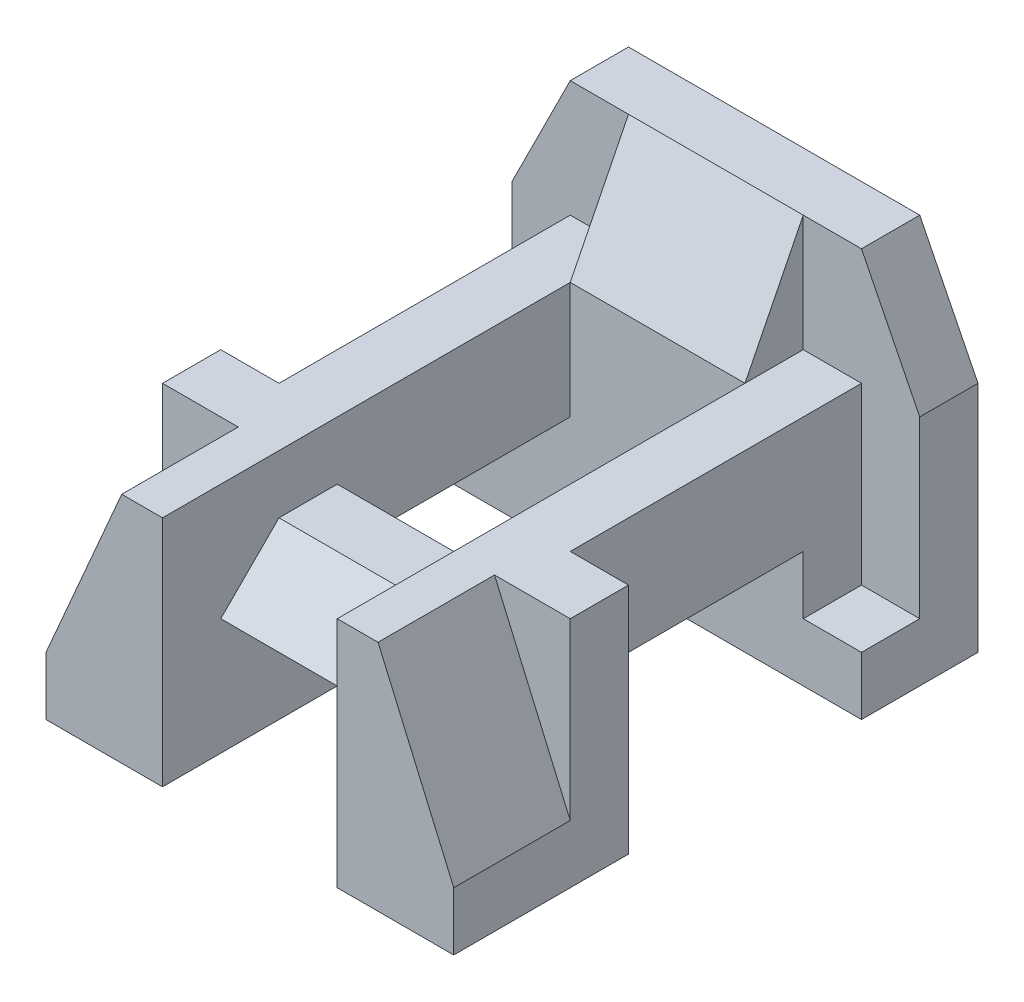
ISO-10303-21;
HEADER;
FILE_DESCRIPTION(('STEP AP214'),'2;1');
FILE_NAME('part.step','',(''),(''),'','','');
FILE_SCHEMA(('AUTOMOTIVE_DESIGN { 1 0 10303 214 1 1 1 1 }'));
ENDSEC;
DATA;
#1=APPLICATION_CONTEXT('core data for automotive mechanical design processes');
#2=APPLICATION_PROTOCOL_DEFINITION('international standard','automotive_design',2000,#1);
#3=PRODUCT_CONTEXT('',#1,'mechanical');
#4=PRODUCT('Part','Part','',(#3));
#5=PRODUCT_RELATED_PRODUCT_CATEGORY('part','',(#4));
#6=PRODUCT_DEFINITION_FORMATION('','',#4);
#7=PRODUCT_DEFINITION_CONTEXT('part definition',#1,'design');
#8=PRODUCT_DEFINITION('design','',#6,#7);
#9=PRODUCT_DEFINITION_SHAPE('','',#8);
#10=(LENGTH_UNIT() NAMED_UNIT(*) SI_UNIT(.MILLI.,.METRE.));
#11=(NAMED_UNIT(*) PLANE_ANGLE_UNIT() SI_UNIT($,.RADIAN.));
#12=(NAMED_UNIT(*) SI_UNIT($,.STERADIAN.) SOLID_ANGLE_UNIT());
#13=UNCERTAINTY_MEASURE_WITH_UNIT(LENGTH_MEASURE(1.E-05),#10,'distance_accuracy_value','');
#14=(GEOMETRIC_REPRESENTATION_CONTEXT(3) GLOBAL_UNCERTAINTY_ASSIGNED_CONTEXT((#13)) GLOBAL_UNIT_ASSIGNED_CONTEXT((#10,
#11,#12)) REPRESENTATION_CONTEXT('',''));
#15=CARTESIAN_POINT('',(0.,0.,0.));
#16=DIRECTION('',(0.,0.,1.));
#17=DIRECTION('',(1.,0.,0.));
#18=AXIS2_PLACEMENT_3D('',#15,#16,#17);
#19=CARTESIAN_POINT('',(1.5,0.,7.));
#20=DIRECTION('',(0.,-1.,0.));
#21=DIRECTION('',(1.,0.,0.));
#22=AXIS2_PLACEMENT_3D('',#19,#20,#21);
#23=PLANE('',#22);
#24=DIRECTION('',(-1.,0.,0.));
#25=VECTOR('',#24,1.);
#26=CARTESIAN_POINT('',(1.5,0.,7.));
#27=LINE('',#26,#25);
#28=CARTESIAN_POINT('',(1.5,0.,7.));
#29=VERTEX_POINT('',#28);
#30=CARTESIAN_POINT('',(-1.5,0.,7.));
#31=VERTEX_POINT('',#30);
#32=EDGE_CURVE('E48',#29,#31,#27,.T.);
#33=ORIENTED_EDGE('',*,*,#32,.F.);
#34=DIRECTION('',(0.,0.,1.));
#35=VECTOR('',#34,1.);
#36=CARTESIAN_POINT('',(1.5,0.,7.));
#37=LINE('',#36,#35);
#38=CARTESIAN_POINT('',(1.5,0.,6.));
#39=VERTEX_POINT('',#38);
#40=EDGE_CURVE('E283',#39,#29,#37,.T.);
#41=ORIENTED_EDGE('',*,*,#40,.F.);
#42=DIRECTION('',(1.,0.,0.));
#43=VECTOR('',#42,1.);
#44=CARTESIAN_POINT('',(-1.5,0.,6.));
#45=LINE('',#44,#43);
#46=CARTESIAN_POINT('',(-1.5,0.,6.));
#47=VERTEX_POINT('',#46);
#48=EDGE_CURVE('E534',#47,#39,#45,.T.);
#49=ORIENTED_EDGE('',*,*,#48,.F.);
#50=DIRECTION('',(0.,0.,1.));
#51=VECTOR('',#50,1.);
#52=CARTESIAN_POINT('',(-1.5,0.,7.));
#53=LINE('',#52,#51);
#54=EDGE_CURVE('E537',#47,#31,#53,.T.);
#55=ORIENTED_EDGE('',*,*,#54,.T.);
#56=EDGE_LOOP('',(#33,#41,#49,#55));
#57=FACE_BOUND('',#56,.T.);
#58=ADVANCED_FACE('F33',(#57),#23,.F.);
#59=CARTESIAN_POINT('',(3.5,-3.,9.));
#60=DIRECTION('',(0.,1.,0.));
#61=DIRECTION('',(-1.,0.,0.));
#62=AXIS2_PLACEMENT_3D('',#59,#60,#61);
#63=PLANE('',#62);
#64=DIRECTION('',(-1.,0.,0.));
#65=VECTOR('',#64,1.);
#66=CARTESIAN_POINT('',(3.5,-3.,2.));
#67=LINE('',#66,#65);
#68=CARTESIAN_POINT('',(3.5,-3.,2.));
#69=VERTEX_POINT('',#68);
#70=CARTESIAN_POINT('',(-3.5,-3.,2.));
#71=VERTEX_POINT('',#70);
#72=EDGE_CURVE('E315',#69,#71,#67,.T.);
#73=ORIENTED_EDGE('',*,*,#72,.T.);
#74=DIRECTION('',(0.,0.,-1.));
#75=VECTOR('',#74,1.);
#76=CARTESIAN_POINT('',(-3.5,-3.,9.));
#77=LINE('',#76,#75);
#78=CARTESIAN_POINT('',(-3.5,-3.,0.));
#79=VERTEX_POINT('',#78);
#80=EDGE_CURVE('E424',#71,#79,#77,.T.);
#81=ORIENTED_EDGE('',*,*,#80,.T.);
#82=DIRECTION('',(1.,0.,0.));
#83=VECTOR('',#82,1.);
#84=CARTESIAN_POINT('',(3.5,-3.,0.));
#85=LINE('',#84,#83);
#86=CARTESIAN_POINT('',(3.5,-3.,0.));
#87=VERTEX_POINT('',#86);
#88=EDGE_CURVE('E413',#79,#87,#85,.T.);
#89=ORIENTED_EDGE('',*,*,#88,.T.);
#90=DIRECTION('',(0.,0.,-1.));
#91=VECTOR('',#90,1.);
#92=CARTESIAN_POINT('',(3.5,-3.,9.));
#93=LINE('',#92,#91);
#94=EDGE_CURVE('E410',#69,#87,#93,.T.);
#95=ORIENTED_EDGE('',*,*,#94,.F.);
#96=EDGE_LOOP('',(#73,#81,#89,#95));
#97=FACE_BOUND('',#96,.T.);
#98=ADVANCED_FACE('F432',(#97),#63,.F.);
#99=DIRECTION('',(0.,0.,-1.));
#100=VECTOR('',#99,1.);
#101=CARTESIAN_POINT('',(-2.5,-3.,2.));
#102=LINE('',#101,#100);
#103=CARTESIAN_POINT('',(-2.5,-3.,6.));
#104=VERTEX_POINT('',#103);
#105=CARTESIAN_POINT('',(-2.5,-3.,5.));
#106=VERTEX_POINT('',#105);
#107=EDGE_CURVE('E308',#104,#106,#102,.T.);
#108=ORIENTED_EDGE('',*,*,#107,.T.);
#109=DIRECTION('',(1.,0.,0.));
#110=VECTOR('',#109,1.);
#111=CARTESIAN_POINT('',(-37.5,-3.00000000000001,5.));
#112=LINE('',#111,#110);
#113=CARTESIAN_POINT('',(-1.5,-3.,5.));
#114=VERTEX_POINT('',#113);
#115=EDGE_CURVE('E479',#106,#114,#112,.T.);
#116=ORIENTED_EDGE('',*,*,#115,.T.);
#117=DIRECTION('',(0.,0.,1.));
#118=VECTOR('',#117,1.);
#119=CARTESIAN_POINT('',(-1.5,-3.,9.));
#120=LINE('',#119,#118);
#121=CARTESIAN_POINT('',(-1.5,-3.,9.));
#122=VERTEX_POINT('',#121);
#123=EDGE_CURVE('E392',#114,#122,#120,.T.);
#124=ORIENTED_EDGE('',*,*,#123,.T.);
#125=DIRECTION('',(1.,0.,0.));
#126=VECTOR('',#125,1.);
#127=CARTESIAN_POINT('',(3.5,-3.,9.));
#128=LINE('',#127,#126);
#129=CARTESIAN_POINT('',(-3.5,-3.,9.));
#130=VERTEX_POINT('',#129);
#131=EDGE_CURVE('E404',#130,#122,#128,.T.);
#132=ORIENTED_EDGE('',*,*,#131,.F.);
#133=CARTESIAN_POINT('',(-3.5,-3.,6.));
#134=VERTEX_POINT('',#133);
#135=EDGE_CURVE('E425',#130,#134,#77,.T.);
#136=ORIENTED_EDGE('',*,*,#135,.T.);
#137=DIRECTION('',(1.,0.,0.));
#138=VECTOR('',#137,1.);
#139=CARTESIAN_POINT('',(-2.5,-3.,6.));
#140=LINE('',#139,#138);
#141=EDGE_CURVE('E305',#134,#104,#140,.T.);
#142=ORIENTED_EDGE('',*,*,#141,.T.);
#143=EDGE_LOOP('',(#108,#116,#124,#132,#136,#142));
#144=FACE_BOUND('',#143,.T.);
#145=ADVANCED_FACE('F661',(#144),#63,.F.);
#146=CARTESIAN_POINT('',(3.5,3.,9.));
#147=DIRECTION('',(0.,-1.,0.));
#148=DIRECTION('',(1.,0.,0.));
#149=AXIS2_PLACEMENT_3D('',#146,#147,#148);
#150=PLANE('',#149);
#151=DIRECTION('',(0.,0.,-1.));
#152=VECTOR('',#151,1.);
#153=CARTESIAN_POINT('',(-2.5,3.,1.));
#154=LINE('',#153,#152);
#155=CARTESIAN_POINT('',(-2.5,3.,1.));
#156=VERTEX_POINT('',#155);
#157=CARTESIAN_POINT('',(-2.5,3.,0.));
#158=VERTEX_POINT('',#157);
#159=EDGE_CURVE('E373',#156,#158,#154,.T.);
#160=ORIENTED_EDGE('',*,*,#159,.F.);
#161=DIRECTION('',(-1.,0.,0.));
#162=VECTOR('',#161,1.);
#163=CARTESIAN_POINT('',(-1.5,3.,1.));
#164=LINE('',#163,#162);
#165=CARTESIAN_POINT('',(-1.5,3.,1.));
#166=VERTEX_POINT('',#165);
#167=EDGE_CURVE('E508',#166,#156,#164,.T.);
#168=ORIENTED_EDGE('',*,*,#167,.F.);
#169=DIRECTION('',(-1.,0.,0.));
#170=VECTOR('',#169,1.);
#171=CARTESIAN_POINT('',(-1.5,3.,1.));
#172=LINE('',#171,#170);
#173=CARTESIAN_POINT('',(1.5,3.,1.));
#174=VERTEX_POINT('',#173);
#175=EDGE_CURVE('E520',#174,#166,#172,.T.);
#176=ORIENTED_EDGE('',*,*,#175,.F.);
#177=DIRECTION('',(1.,0.,0.));
#178=VECTOR('',#177,1.);
#179=CARTESIAN_POINT('',(1.5,3.,1.));
#180=LINE('',#179,#178);
#181=CARTESIAN_POINT('',(2.5,3.,1.));
#182=VERTEX_POINT('',#181);
#183=EDGE_CURVE('E518',#174,#182,#180,.T.);
#184=ORIENTED_EDGE('',*,*,#183,.T.);
#185=DIRECTION('',(0.,0.,-1.));
#186=VECTOR('',#185,1.);
#187=CARTESIAN_POINT('',(2.5,3.,1.));
#188=LINE('',#187,#186);
#189=CARTESIAN_POINT('',(2.5,3.,0.));
#190=VERTEX_POINT('',#189);
#191=EDGE_CURVE('E385',#182,#190,#188,.T.);
#192=ORIENTED_EDGE('',*,*,#191,.T.);
#193=DIRECTION('',(-1.,0.,0.));
#194=VECTOR('',#193,1.);
#195=CARTESIAN_POINT('',(3.5,3.,0.));
#196=LINE('',#195,#194);
#197=EDGE_CURVE('E403',#190,#158,#196,.T.);
#198=ORIENTED_EDGE('',*,*,#197,.T.);
#199=EDGE_LOOP('',(#160,#168,#176,#184,#192,#198));
#200=FACE_BOUND('',#199,.T.);
#201=ADVANCED_FACE('F634',(#200),#150,.F.);
#202=CARTESIAN_POINT('',(1.5,0.999999999999999,3.));
#203=DIRECTION('',(0.,-1.,0.));
#204=DIRECTION('',(1.,0.,0.));
#205=AXIS2_PLACEMENT_3D('',#202,#203,#204);
#206=PLANE('',#205);
#207=DIRECTION('',(0.,0.,1.));
#208=VECTOR('',#207,1.);
#209=CARTESIAN_POINT('',(2.5,1.,1.));
#210=LINE('',#209,#208);
#211=CARTESIAN_POINT('',(2.5,1.,1.));
#212=VERTEX_POINT('',#211);
#213=CARTESIAN_POINT('',(2.5,1.,6.));
#214=VERTEX_POINT('',#213);
#215=EDGE_CURVE('E569',#212,#214,#210,.T.);
#216=ORIENTED_EDGE('',*,*,#215,.F.);
#217=DIRECTION('',(1.,0.,0.));
#218=VECTOR('',#217,1.);
#219=CARTESIAN_POINT('',(1.5,1.,1.));
#220=LINE('',#219,#218);
#221=CARTESIAN_POINT('',(1.5,1.,1.));
#222=VERTEX_POINT('',#221);
#223=EDGE_CURVE('E517',#222,#212,#220,.T.);
#224=ORIENTED_EDGE('',*,*,#223,.F.);
#225=DIRECTION('',(0.,0.,-1.));
#226=VECTOR('',#225,1.);
#227=CARTESIAN_POINT('',(1.5,1.,1.));
#228=LINE('',#227,#226);
#229=CARTESIAN_POINT('',(1.5,1.,2.));
#230=VERTEX_POINT('',#229);
#231=EDGE_CURVE('E510',#230,#222,#228,.T.);
#232=ORIENTED_EDGE('',*,*,#231,.F.);
#233=DIRECTION('',(0.,0.,-1.));
#234=VECTOR('',#233,1.);
#235=CARTESIAN_POINT('',(1.5,1.,9.));
#236=LINE('',#235,#234);
#237=CARTESIAN_POINT('',(1.5,1.,9.));
#238=VERTEX_POINT('',#237);
#239=EDGE_CURVE('E568',#238,#230,#236,.T.);
#240=ORIENTED_EDGE('',*,*,#239,.F.);
#241=DIRECTION('',(1.,0.,0.));
#242=VECTOR('',#241,1.);
#243=CARTESIAN_POINT('',(3.5,1.,9.));
#244=LINE('',#243,#242);
#245=CARTESIAN_POINT('',(2.2,1.,9.));
#246=VERTEX_POINT('',#245);
#247=EDGE_CURVE('E556',#238,#246,#244,.T.);
#248=ORIENTED_EDGE('',*,*,#247,.T.);
#249=DIRECTION('',(0.,0.,1.));
#250=VECTOR('',#249,1.);
#251=CARTESIAN_POINT('',(2.2,1.,7.));
#252=LINE('',#251,#250);
#253=CARTESIAN_POINT('',(2.2,1.,7.));
#254=VERTEX_POINT('',#253);
#255=EDGE_CURVE('E553',#254,#246,#252,.T.);
#256=ORIENTED_EDGE('',*,*,#255,.F.);
#257=DIRECTION('',(1.,0.,0.));
#258=VECTOR('',#257,1.);
#259=CARTESIAN_POINT('',(0.,1.,7.));
#260=LINE('',#259,#258);
#261=CARTESIAN_POINT('',(3.5,1.,7.));
#262=VERTEX_POINT('',#261);
#263=EDGE_CURVE('E575',#254,#262,#260,.T.);
#264=ORIENTED_EDGE('',*,*,#263,.T.);
#265=DIRECTION('',(0.,0.,1.));
#266=VECTOR('',#265,1.);
#267=CARTESIAN_POINT('',(3.5,1.,2.));
#268=LINE('',#267,#266);
#269=CARTESIAN_POINT('',(3.5,1.,6.));
#270=VERTEX_POINT('',#269);
#271=EDGE_CURVE('E560',#270,#262,#268,.T.);
#272=ORIENTED_EDGE('',*,*,#271,.F.);
#273=DIRECTION('',(1.,0.,0.));
#274=VECTOR('',#273,1.);
#275=CARTESIAN_POINT('',(2.5,1.,6.));
#276=LINE('',#275,#274);
#277=EDGE_CURVE('E582',#214,#270,#276,.T.);
#278=ORIENTED_EDGE('',*,*,#277,.F.);
#279=EDGE_LOOP('',(#216,#224,#232,#240,#248,#256,#264,#272,#278));
#280=FACE_BOUND('',#279,.T.);
#281=ADVANCED_FACE('F602',(#280),#206,.F.);
#282=CARTESIAN_POINT('',(-3.5,-3.,9.));
#283=DIRECTION('',(1.,0.,0.));
#284=DIRECTION('',(0.,0.,-1.));
#285=AXIS2_PLACEMENT_3D('',#282,#283,#284);
#286=PLANE('',#285);
#287=ORIENTED_EDGE('',*,*,#80,.F.);
#288=DIRECTION('',(0.,1.,0.));
#289=VECTOR('',#288,1.);
#290=CARTESIAN_POINT('',(-3.5,-3.,2.));
#291=LINE('',#290,#289);
#292=CARTESIAN_POINT('',(-3.5,-2.,2.));
#293=VERTEX_POINT('',#292);
#294=EDGE_CURVE('E312',#71,#293,#291,.T.);
#295=ORIENTED_EDGE('',*,*,#294,.T.);
#296=DIRECTION('',(0.,0.,1.));
#297=VECTOR('',#296,1.);
#298=CARTESIAN_POINT('',(-3.5,-2.,2.));
#299=LINE('',#298,#297);
#300=CARTESIAN_POINT('',(-3.5,-2.,1.));
#301=VERTEX_POINT('',#300);
#302=EDGE_CURVE('E331',#301,#293,#299,.T.);
#303=ORIENTED_EDGE('',*,*,#302,.F.);
#304=DIRECTION('',(0.,1.,0.));
#305=VECTOR('',#304,1.);
#306=CARTESIAN_POINT('',(-3.5,-2.,1.));
#307=LINE('',#306,#305);
#308=CARTESIAN_POINT('',(-3.5,0.999999999999999,1.));
#309=VERTEX_POINT('',#308);
#310=EDGE_CURVE('E348',#301,#309,#307,.T.);
#311=ORIENTED_EDGE('',*,*,#310,.T.);
#312=DIRECTION('',(0.,0.,-1.));
#313=VECTOR('',#312,1.);
#314=CARTESIAN_POINT('',(-3.5,0.999999999999999,1.));
#315=LINE('',#314,#313);
#316=CARTESIAN_POINT('',(-3.5,0.999999999999999,0.));
#317=VERTEX_POINT('',#316);
#318=EDGE_CURVE('E375',#309,#317,#315,.T.);
#319=ORIENTED_EDGE('',*,*,#318,.T.);
#320=DIRECTION('',(0.,-1.,0.));
#321=VECTOR('',#320,1.);
#322=CARTESIAN_POINT('',(-3.5,-3.,0.));
#323=LINE('',#322,#321);
#324=EDGE_CURVE('E397',#317,#79,#323,.T.);
#325=ORIENTED_EDGE('',*,*,#324,.T.);
#326=EDGE_LOOP('',(#287,#295,#303,#311,#319,#325));
#327=FACE_BOUND('',#326,.T.);
#328=ADVANCED_FACE('F439',(#327),#286,.F.);
#329=CARTESIAN_POINT('',(3.5,-3.,9.));
#330=DIRECTION('',(-1.,0.,0.));
#331=DIRECTION('',(0.,0.,1.));
#332=AXIS2_PLACEMENT_3D('',#329,#330,#331);
#333=PLANE('',#332);
#334=DIRECTION('',(0.,1.,0.));
#335=VECTOR('',#334,1.);
#336=CARTESIAN_POINT('',(3.5,-3.,6.));
#337=LINE('',#336,#335);
#338=CARTESIAN_POINT('',(3.5,-3.,6.));
#339=VERTEX_POINT('',#338);
#340=EDGE_CURVE('E328',#339,#270,#337,.T.);
#341=ORIENTED_EDGE('',*,*,#340,.T.);
#342=ORIENTED_EDGE('',*,*,#271,.T.);
#343=DIRECTION('',(0.,1.,0.));
#344=VECTOR('',#343,1.);
#345=CARTESIAN_POINT('',(3.5,-2.,7.));
#346=LINE('',#345,#344);
#347=CARTESIAN_POINT('',(3.5,-2.,7.));
#348=VERTEX_POINT('',#347);
#349=EDGE_CURVE('E299',#348,#262,#346,.T.);
#350=ORIENTED_EDGE('',*,*,#349,.F.);
#351=DIRECTION('',(0.,0.,1.));
#352=VECTOR('',#351,1.);
#353=CARTESIAN_POINT('',(3.5,-2.,7.));
#354=LINE('',#353,#352);
#355=CARTESIAN_POINT('',(3.5,-2.,9.));
#356=VERTEX_POINT('',#355);
#357=EDGE_CURVE('E302',#348,#356,#354,.T.);
#358=ORIENTED_EDGE('',*,*,#357,.T.);
#359=DIRECTION('',(0.,1.,0.));
#360=VECTOR('',#359,1.);
#361=CARTESIAN_POINT('',(3.5,-3.,9.));
#362=LINE('',#361,#360);
#363=CARTESIAN_POINT('',(3.5,-3.,9.));
#364=VERTEX_POINT('',#363);
#365=EDGE_CURVE('E407',#364,#356,#362,.T.);
#366=ORIENTED_EDGE('',*,*,#365,.F.);
#367=EDGE_CURVE('E421',#364,#339,#93,.T.);
#368=ORIENTED_EDGE('',*,*,#367,.T.);
#369=EDGE_LOOP('',(#341,#342,#350,#358,#366,#368));
#370=FACE_BOUND('',#369,.T.);
#371=ADVANCED_FACE('F616',(#370),#333,.F.);
#372=CARTESIAN_POINT('',(0.,0.,9.));
#373=DIRECTION('',(0.,0.,1.));
#374=DIRECTION('',(1.,0.,0.));
#375=AXIS2_PLACEMENT_3D('',#372,#373,#374);
#376=PLANE('',#375);
#377=DIRECTION('',(0.3976074376343,-0.917555625309924,0.));
#378=VECTOR('',#377,1.);
#379=CARTESIAN_POINT('',(2.2,1.,9.));
#380=LINE('',#379,#378);
#381=EDGE_CURVE('E549',#246,#356,#380,.T.);
#382=ORIENTED_EDGE('',*,*,#381,.F.);
#383=ORIENTED_EDGE('',*,*,#247,.F.);
#384=DIRECTION('',(0.,1.,0.));
#385=VECTOR('',#384,1.);
#386=CARTESIAN_POINT('',(1.5,-3.,9.));
#387=LINE('',#386,#385);
#388=CARTESIAN_POINT('',(1.5,-3.,9.));
#389=VERTEX_POINT('',#388);
#390=EDGE_CURVE('E395',#389,#238,#387,.T.);
#391=ORIENTED_EDGE('',*,*,#390,.F.);
#392=EDGE_CURVE('E402',#389,#364,#128,.T.);
#393=ORIENTED_EDGE('',*,*,#392,.T.);
#394=ORIENTED_EDGE('',*,*,#365,.T.);
#395=EDGE_LOOP('',(#382,#383,#391,#393,#394));
#396=FACE_BOUND('',#395,.T.);
#397=ADVANCED_FACE('F609',(#396),#376,.T.);
#398=DIRECTION('',(0.,-1.,0.));
#399=VECTOR('',#398,1.);
#400=CARTESIAN_POINT('',(-3.5,-2.,7.));
#401=LINE('',#400,#399);
#402=CARTESIAN_POINT('',(-3.5,0.999999999999999,7.));
#403=VERTEX_POINT('',#402);
#404=CARTESIAN_POINT('',(-3.5,-2.00000000000004,7.));
#405=VERTEX_POINT('',#404);
#406=EDGE_CURVE('E290',#403,#405,#401,.T.);
#407=ORIENTED_EDGE('',*,*,#406,.F.);
#408=DIRECTION('',(0.,0.,1.));
#409=VECTOR('',#408,1.);
#410=CARTESIAN_POINT('',(-3.5,0.999999999999999,2.));
#411=LINE('',#410,#409);
#412=CARTESIAN_POINT('',(-3.5,0.999999999999999,6.));
#413=VERTEX_POINT('',#412);
#414=EDGE_CURVE('E564',#413,#403,#411,.T.);
#415=ORIENTED_EDGE('',*,*,#414,.F.);
#416=DIRECTION('',(0.,1.,0.));
#417=VECTOR('',#416,1.);
#418=CARTESIAN_POINT('',(-3.5,-3.,6.));
#419=LINE('',#418,#417);
#420=EDGE_CURVE('E311',#134,#413,#419,.T.);
#421=ORIENTED_EDGE('',*,*,#420,.F.);
#422=ORIENTED_EDGE('',*,*,#135,.F.);
#423=DIRECTION('',(0.,-1.,0.));
#424=VECTOR('',#423,1.);
#425=CARTESIAN_POINT('',(-3.5,-3.,9.));
#426=LINE('',#425,#424);
#427=CARTESIAN_POINT('',(-3.5,-2.00000000000004,9.));
#428=VERTEX_POINT('',#427);
#429=EDGE_CURVE('E400',#428,#130,#426,.T.);
#430=ORIENTED_EDGE('',*,*,#429,.F.);
#431=DIRECTION('',(0.,0.,1.));
#432=VECTOR('',#431,1.);
#433=CARTESIAN_POINT('',(-3.5,-2.,7.));
#434=LINE('',#433,#432);
#435=EDGE_CURVE('E297',#405,#428,#434,.T.);
#436=ORIENTED_EDGE('',*,*,#435,.F.);
#437=EDGE_LOOP('',(#407,#415,#421,#422,#430,#436));
#438=FACE_BOUND('',#437,.T.);
#439=ADVANCED_FACE('F35',(#438),#286,.F.);
#440=DIRECTION('',(0.,0.,-1.));
#441=VECTOR('',#440,1.);
#442=CARTESIAN_POINT('',(1.5,-3.,9.));
#443=LINE('',#442,#441);
#444=CARTESIAN_POINT('',(1.5,-3.,5.));
#445=VERTEX_POINT('',#444);
#446=EDGE_CURVE('E388',#389,#445,#443,.T.);
#447=ORIENTED_EDGE('',*,*,#446,.T.);
#448=CARTESIAN_POINT('',(2.5,-3.,5.));
#449=VERTEX_POINT('',#448);
#450=EDGE_CURVE('E476',#445,#449,#112,.T.);
#451=ORIENTED_EDGE('',*,*,#450,.T.);
#452=DIRECTION('',(0.,0.,1.));
#453=VECTOR('',#452,1.);
#454=CARTESIAN_POINT('',(2.5,-3.,2.));
#455=LINE('',#454,#453);
#456=CARTESIAN_POINT('',(2.5,-3.,6.));
#457=VERTEX_POINT('',#456);
#458=EDGE_CURVE('E322',#449,#457,#455,.T.);
#459=ORIENTED_EDGE('',*,*,#458,.T.);
#460=DIRECTION('',(1.,0.,0.));
#461=VECTOR('',#460,1.);
#462=CARTESIAN_POINT('',(2.5,-3.,6.));
#463=LINE('',#462,#461);
#464=EDGE_CURVE('E324',#457,#339,#463,.T.);
#465=ORIENTED_EDGE('',*,*,#464,.T.);
#466=ORIENTED_EDGE('',*,*,#367,.F.);
#467=ORIENTED_EDGE('',*,*,#392,.F.);
#468=EDGE_LOOP('',(#447,#451,#459,#465,#466,#467));
#469=FACE_BOUND('',#468,.T.);
#470=ADVANCED_FACE('F612',(#469),#63,.F.);
#471=DIRECTION('',(0.,0.,-1.));
#472=VECTOR('',#471,1.);
#473=CARTESIAN_POINT('',(3.5,-2.,2.));
#474=LINE('',#473,#472);
#475=CARTESIAN_POINT('',(3.5,-2.,2.));
#476=VERTEX_POINT('',#475);
#477=CARTESIAN_POINT('',(3.5,-2.,1.));
#478=VERTEX_POINT('',#477);
#479=EDGE_CURVE('E351',#476,#478,#474,.T.);
#480=ORIENTED_EDGE('',*,*,#479,.F.);
#481=DIRECTION('',(0.,1.,0.));
#482=VECTOR('',#481,1.);
#483=CARTESIAN_POINT('',(3.5,-3.,2.));
#484=LINE('',#483,#482);
#485=EDGE_CURVE('E327',#69,#476,#484,.T.);
#486=ORIENTED_EDGE('',*,*,#485,.F.);
#487=ORIENTED_EDGE('',*,*,#94,.T.);
#488=DIRECTION('',(0.,1.,0.));
#489=VECTOR('',#488,1.);
#490=CARTESIAN_POINT('',(3.5,-3.,0.));
#491=LINE('',#490,#489);
#492=CARTESIAN_POINT('',(3.5,1.,0.));
#493=VERTEX_POINT('',#492);
#494=EDGE_CURVE('E416',#87,#493,#491,.T.);
#495=ORIENTED_EDGE('',*,*,#494,.T.);
#496=DIRECTION('',(0.,0.,-1.));
#497=VECTOR('',#496,1.);
#498=CARTESIAN_POINT('',(3.5,1.,1.));
#499=LINE('',#498,#497);
#500=CARTESIAN_POINT('',(3.5,1.,1.));
#501=VERTEX_POINT('',#500);
#502=EDGE_CURVE('E383',#501,#493,#499,.T.);
#503=ORIENTED_EDGE('',*,*,#502,.F.);
#504=DIRECTION('',(0.,1.,0.));
#505=VECTOR('',#504,1.);
#506=CARTESIAN_POINT('',(3.5,-2.,1.));
#507=LINE('',#506,#505);
#508=EDGE_CURVE('E365',#478,#501,#507,.T.);
#509=ORIENTED_EDGE('',*,*,#508,.F.);
#510=EDGE_LOOP('',(#480,#486,#487,#495,#503,#509));
#511=FACE_BOUND('',#510,.T.);
#512=ADVANCED_FACE('F449',(#511),#333,.F.);
#513=DIRECTION('',(0.397607437634298,0.917555625309925,0.));
#514=VECTOR('',#513,1.);
#515=CARTESIAN_POINT('',(-3.5,-2.00000000000004,9.));
#516=LINE('',#515,#514);
#517=CARTESIAN_POINT('',(-2.2,0.999999999999999,9.));
#518=VERTEX_POINT('',#517);
#519=EDGE_CURVE('E539',#428,#518,#516,.T.);
#520=ORIENTED_EDGE('',*,*,#519,.F.);
#521=ORIENTED_EDGE('',*,*,#429,.T.);
#522=ORIENTED_EDGE('',*,*,#131,.T.);
#523=DIRECTION('',(0.,1.,0.));
#524=VECTOR('',#523,1.);
#525=CARTESIAN_POINT('',(-1.5,-3.,9.));
#526=LINE('',#525,#524);
#527=CARTESIAN_POINT('',(-1.5,0.999999999999999,9.));
#528=VERTEX_POINT('',#527);
#529=EDGE_CURVE('E394',#122,#528,#526,.T.);
#530=ORIENTED_EDGE('',*,*,#529,.T.);
#531=EDGE_CURVE('E559',#518,#528,#244,.T.);
#532=ORIENTED_EDGE('',*,*,#531,.F.);
#533=EDGE_LOOP('',(#520,#521,#522,#530,#532));
#534=FACE_BOUND('',#533,.T.);
#535=ADVANCED_FACE('F1007',(#534),#376,.T.);
#536=CARTESIAN_POINT('',(0.,0.,0.));
#537=DIRECTION('',(0.,0.,1.));
#538=DIRECTION('',(1.,0.,0.));
#539=AXIS2_PLACEMENT_3D('',#536,#537,#538);
#540=PLANE('',#539);
#541=ORIENTED_EDGE('',*,*,#324,.F.);
#542=DIRECTION('',(-0.447213595499958,-0.894427190999916,0.));
#543=VECTOR('',#542,1.);
#544=CARTESIAN_POINT('',(-2.5,3.,0.));
#545=LINE('',#544,#543);
#546=EDGE_CURVE('E369',#158,#317,#545,.T.);
#547=ORIENTED_EDGE('',*,*,#546,.F.);
#548=ORIENTED_EDGE('',*,*,#197,.F.);
#549=DIRECTION('',(-0.447213595499958,0.894427190999916,0.));
#550=VECTOR('',#549,1.);
#551=CARTESIAN_POINT('',(2.5,3.,0.));
#552=LINE('',#551,#550);
#553=EDGE_CURVE('E378',#493,#190,#552,.T.);
#554=ORIENTED_EDGE('',*,*,#553,.F.);
#555=ORIENTED_EDGE('',*,*,#494,.F.);
#556=ORIENTED_EDGE('',*,*,#88,.F.);
#557=EDGE_LOOP('',(#541,#547,#548,#554,#555,#556));
#558=FACE_BOUND('',#557,.T.);
#559=ADVANCED_FACE('F443',(#558),#540,.F.);
#560=CARTESIAN_POINT('',(1.5,-3.,9.));
#561=DIRECTION('',(1.,0.,0.));
#562=DIRECTION('',(0.,1.,0.));
#563=AXIS2_PLACEMENT_3D('',#560,#561,#562);
#564=PLANE('',#563);
#565=ORIENTED_EDGE('',*,*,#40,.T.);
#566=DIRECTION('',(0.,0.707106781186548,-0.707106781186547));
#567=VECTOR('',#566,1.);
#568=CARTESIAN_POINT('',(1.5,0.,7.));
#569=LINE('',#568,#567);
#570=CARTESIAN_POINT('',(1.5,-1.,8.));
#571=VERTEX_POINT('',#570);
#572=EDGE_CURVE('E267',#571,#29,#569,.T.);
#573=ORIENTED_EDGE('',*,*,#572,.F.);
#574=DIRECTION('',(0.,0.,1.));
#575=VECTOR('',#574,1.);
#576=CARTESIAN_POINT('',(1.5,-1.,2.));
#577=LINE('',#576,#575);
#578=CARTESIAN_POINT('',(1.5,-1.,6.));
#579=VERTEX_POINT('',#578);
#580=EDGE_CURVE('E282',#579,#571,#577,.T.);
#581=ORIENTED_EDGE('',*,*,#580,.F.);
#582=DIRECTION('',(0.,1.,0.));
#583=VECTOR('',#582,1.);
#584=CARTESIAN_POINT('',(1.5,-3.,6.));
#585=LINE('',#584,#583);
#586=EDGE_CURVE('E274',#579,#39,#585,.T.);
#587=ORIENTED_EDGE('',*,*,#586,.T.);
#588=EDGE_LOOP('',(#565,#573,#581,#587));
#589=FACE_BOUND('',#588,.T.);
#590=DIRECTION('',(0.,0.,1.));
#591=VECTOR('',#590,1.);
#592=CARTESIAN_POINT('',(1.5,-1.,9.));
#593=LINE('',#592,#591);
#594=CARTESIAN_POINT('',(1.5,-1.,2.));
#595=VERTEX_POINT('',#594);
#596=CARTESIAN_POINT('',(1.5,-1.,5.));
#597=VERTEX_POINT('',#596);
#598=EDGE_CURVE('E490',#595,#597,#593,.T.);
#599=ORIENTED_EDGE('',*,*,#598,.T.);
#600=DIRECTION('',(0.,-1.,0.));
#601=VECTOR('',#600,1.);
#602=CARTESIAN_POINT('',(1.5,-3.,5.));
#603=LINE('',#602,#601);
#604=EDGE_CURVE('E499',#597,#445,#603,.T.);
#605=ORIENTED_EDGE('',*,*,#604,.T.);
#606=ORIENTED_EDGE('',*,*,#446,.F.);
#607=ORIENTED_EDGE('',*,*,#390,.T.);
#608=ORIENTED_EDGE('',*,*,#239,.T.);
#609=DIRECTION('',(0.,1.,0.));
#610=VECTOR('',#609,1.);
#611=CARTESIAN_POINT('',(1.5,-1.,2.));
#612=LINE('',#611,#610);
#613=EDGE_CURVE('E273',#595,#230,#612,.T.);
#614=ORIENTED_EDGE('',*,*,#613,.F.);
#615=EDGE_LOOP('',(#599,#605,#606,#607,#608,#614));
#616=FACE_BOUND('',#615,.T.);
#617=ADVANCED_FACE('F279',(#589,#616),#564,.F.);
#618=CARTESIAN_POINT('',(-1.5,-3.,9.));
#619=DIRECTION('',(-1.,0.,0.));
#620=DIRECTION('',(0.,-1.,0.));
#621=AXIS2_PLACEMENT_3D('',#618,#619,#620);
#622=PLANE('',#621);
#623=DIRECTION('',(0.,0.707106781186548,-0.707106781186547));
#624=VECTOR('',#623,1.);
#625=CARTESIAN_POINT('',(-1.5,0.,7.));
#626=LINE('',#625,#624);
#627=CARTESIAN_POINT('',(-1.5,-1.,8.));
#628=VERTEX_POINT('',#627);
#629=EDGE_CURVE('E268',#628,#31,#626,.T.);
#630=ORIENTED_EDGE('',*,*,#629,.T.);
#631=ORIENTED_EDGE('',*,*,#54,.F.);
#632=DIRECTION('',(0.,1.,0.));
#633=VECTOR('',#632,1.);
#634=CARTESIAN_POINT('',(-1.5,-3.,6.));
#635=LINE('',#634,#633);
#636=CARTESIAN_POINT('',(-1.5,-1.,6.));
#637=VERTEX_POINT('',#636);
#638=EDGE_CURVE('E572',#637,#47,#635,.T.);
#639=ORIENTED_EDGE('',*,*,#638,.F.);
#640=DIRECTION('',(0.,0.,1.));
#641=VECTOR('',#640,1.);
#642=CARTESIAN_POINT('',(-1.5,-1.,2.));
#643=LINE('',#642,#641);
#644=EDGE_CURVE('E287',#637,#628,#643,.T.);
#645=ORIENTED_EDGE('',*,*,#644,.T.);
#646=EDGE_LOOP('',(#630,#631,#639,#645));
#647=FACE_BOUND('',#646,.T.);
#648=ORIENTED_EDGE('',*,*,#123,.F.);
#649=DIRECTION('',(0.,1.,0.));
#650=VECTOR('',#649,1.);
#651=CARTESIAN_POINT('',(-1.5,-3.,5.));
#652=LINE('',#651,#650);
#653=CARTESIAN_POINT('',(-1.5,-1.,5.));
#654=VERTEX_POINT('',#653);
#655=EDGE_CURVE('E496',#114,#654,#652,.T.);
#656=ORIENTED_EDGE('',*,*,#655,.T.);
#657=DIRECTION('',(0.,0.,-1.));
#658=VECTOR('',#657,1.);
#659=CARTESIAN_POINT('',(-1.5,-1.,9.));
#660=LINE('',#659,#658);
#661=CARTESIAN_POINT('',(-1.5,-1.,2.));
#662=VERTEX_POINT('',#661);
#663=EDGE_CURVE('E487',#654,#662,#660,.T.);
#664=ORIENTED_EDGE('',*,*,#663,.T.);
#665=DIRECTION('',(0.,-1.,0.));
#666=VECTOR('',#665,1.);
#667=CARTESIAN_POINT('',(-1.5,-3.,2.));
#668=LINE('',#667,#666);
#669=CARTESIAN_POINT('',(-1.5,0.999999999999999,2.));
#670=VERTEX_POINT('',#669);
#671=EDGE_CURVE('E288',#670,#662,#668,.T.);
#672=ORIENTED_EDGE('',*,*,#671,.F.);
#673=DIRECTION('',(0.,0.,1.));
#674=VECTOR('',#673,1.);
#675=CARTESIAN_POINT('',(-1.5,0.999999999999999,9.));
#676=LINE('',#675,#674);
#677=EDGE_CURVE('E566',#670,#528,#676,.T.);
#678=ORIENTED_EDGE('',*,*,#677,.T.);
#679=ORIENTED_EDGE('',*,*,#529,.F.);
#680=EDGE_LOOP('',(#648,#656,#664,#672,#678,#679));
#681=FACE_BOUND('',#680,.T.);
#682=ADVANCED_FACE('F650',(#647,#681),#622,.F.);
#683=CARTESIAN_POINT('',(2.5,3.,1.));
#684=DIRECTION('',(-0.894427190999916,-0.447213595499958,0.));
#685=DIRECTION('',(0.447213595499958,-0.894427190999916,0.));
#686=AXIS2_PLACEMENT_3D('',#683,#684,#685);
#687=PLANE('',#686);
#688=ORIENTED_EDGE('',*,*,#553,.T.);
#689=ORIENTED_EDGE('',*,*,#191,.F.);
#690=DIRECTION('',(-0.447213595499958,0.894427190999916,0.));
#691=VECTOR('',#690,1.);
#692=CARTESIAN_POINT('',(2.5,3.,1.));
#693=LINE('',#692,#691);
#694=EDGE_CURVE('E380',#501,#182,#693,.T.);
#695=ORIENTED_EDGE('',*,*,#694,.F.);
#696=ORIENTED_EDGE('',*,*,#502,.T.);
#697=EDGE_LOOP('',(#688,#689,#695,#696));
#698=FACE_BOUND('',#697,.T.);
#699=ADVANCED_FACE('F643',(#698),#687,.F.);
#700=CARTESIAN_POINT('',(-2.5,3.,1.));
#701=DIRECTION('',(0.894427190999916,-0.447213595499958,0.));
#702=DIRECTION('',(0.447213595499958,0.894427190999916,0.));
#703=AXIS2_PLACEMENT_3D('',#700,#701,#702);
#704=PLANE('',#703);
#705=ORIENTED_EDGE('',*,*,#546,.T.);
#706=ORIENTED_EDGE('',*,*,#318,.F.);
#707=DIRECTION('',(-0.447213595499958,-0.894427190999916,0.));
#708=VECTOR('',#707,1.);
#709=CARTESIAN_POINT('',(-2.5,3.,1.));
#710=LINE('',#709,#708);
#711=EDGE_CURVE('E371',#156,#309,#710,.T.);
#712=ORIENTED_EDGE('',*,*,#711,.F.);
#713=ORIENTED_EDGE('',*,*,#159,.T.);
#714=EDGE_LOOP('',(#705,#706,#712,#713));
#715=FACE_BOUND('',#714,.T.);
#716=ADVANCED_FACE('F641',(#715),#704,.F.);
#717=CARTESIAN_POINT('',(3.5,-2.,1.));
#718=DIRECTION('',(0.,0.,-1.));
#719=DIRECTION('',(-1.,0.,0.));
#720=AXIS2_PLACEMENT_3D('',#717,#718,#719);
#721=PLANE('',#720);
#722=DIRECTION('',(0.,1.,0.));
#723=VECTOR('',#722,1.);
#724=CARTESIAN_POINT('',(2.5,-2.,1.));
#725=LINE('',#724,#723);
#726=CARTESIAN_POINT('',(2.5,-2.,1.));
#727=VERTEX_POINT('',#726);
#728=EDGE_CURVE('E366',#727,#212,#725,.T.);
#729=ORIENTED_EDGE('',*,*,#728,.F.);
#730=DIRECTION('',(-1.,0.,0.));
#731=VECTOR('',#730,1.);
#732=CARTESIAN_POINT('',(3.5,-2.,1.));
#733=LINE('',#732,#731);
#734=EDGE_CURVE('E356',#478,#727,#733,.T.);
#735=ORIENTED_EDGE('',*,*,#734,.F.);
#736=ORIENTED_EDGE('',*,*,#508,.T.);
#737=ORIENTED_EDGE('',*,*,#694,.T.);
#738=ORIENTED_EDGE('',*,*,#183,.F.);
#739=DIRECTION('',(0.,1.,0.));
#740=VECTOR('',#739,1.);
#741=CARTESIAN_POINT('',(1.5,3.,1.));
#742=LINE('',#741,#740);
#743=EDGE_CURVE('E515',#222,#174,#742,.T.);
#744=ORIENTED_EDGE('',*,*,#743,.F.);
#745=ORIENTED_EDGE('',*,*,#223,.T.);
#746=EDGE_LOOP('',(#729,#735,#736,#737,#738,#744,#745));
#747=FACE_BOUND('',#746,.T.);
#748=ADVANCED_FACE('F629',(#747),#721,.F.);
#749=CARTESIAN_POINT('',(2.5,-2.,1.));
#750=DIRECTION('',(-1.,0.,0.));
#751=DIRECTION('',(0.,-1.,0.));
#752=AXIS2_PLACEMENT_3D('',#749,#750,#751);
#753=PLANE('',#752);
#754=DIRECTION('',(0.,0.,1.));
#755=VECTOR('',#754,1.);
#756=CARTESIAN_POINT('',(2.5,-1.,2.));
#757=LINE('',#756,#755);
#758=CARTESIAN_POINT('',(2.5,-1.,2.));
#759=VERTEX_POINT('',#758);
#760=CARTESIAN_POINT('',(2.5,-1.,5.));
#761=VERTEX_POINT('',#760);
#762=EDGE_CURVE('E465',#759,#761,#757,.T.);
#763=ORIENTED_EDGE('',*,*,#762,.F.);
#764=DIRECTION('',(0.,1.,0.));
#765=VECTOR('',#764,1.);
#766=CARTESIAN_POINT('',(2.5,-3.,2.));
#767=LINE('',#766,#765);
#768=CARTESIAN_POINT('',(2.5,-2.,2.));
#769=VERTEX_POINT('',#768);
#770=EDGE_CURVE('E462',#769,#759,#767,.T.);
#771=ORIENTED_EDGE('',*,*,#770,.F.);
#772=DIRECTION('',(0.,0.,1.));
#773=VECTOR('',#772,1.);
#774=CARTESIAN_POINT('',(2.5,-2.,1.));
#775=LINE('',#774,#773);
#776=EDGE_CURVE('E359',#727,#769,#775,.T.);
#777=ORIENTED_EDGE('',*,*,#776,.F.);
#778=ORIENTED_EDGE('',*,*,#728,.T.);
#779=ORIENTED_EDGE('',*,*,#215,.T.);
#780=DIRECTION('',(0.,1.,0.));
#781=VECTOR('',#780,1.);
#782=CARTESIAN_POINT('',(2.5,-3.,6.));
#783=LINE('',#782,#781);
#784=EDGE_CURVE('E332',#457,#214,#783,.T.);
#785=ORIENTED_EDGE('',*,*,#784,.F.);
#786=ORIENTED_EDGE('',*,*,#458,.F.);
#787=DIRECTION('',(0.,-1.,0.));
#788=VECTOR('',#787,1.);
#789=CARTESIAN_POINT('',(2.5,-3.,5.));
#790=LINE('',#789,#788);
#791=EDGE_CURVE('E469',#761,#449,#790,.T.);
#792=ORIENTED_EDGE('',*,*,#791,.F.);
#793=EDGE_LOOP('',(#763,#771,#777,#778,#779,#785,#786,#792));
#794=FACE_BOUND('',#793,.T.);
#795=ADVANCED_FACE('F460',(#794),#753,.F.);
#796=CARTESIAN_POINT('',(0.,-2.,0.));
#797=DIRECTION('',(0.,1.,0.));
#798=DIRECTION('',(0.,0.,1.));
#799=AXIS2_PLACEMENT_3D('',#796,#797,#798);
#800=PLANE('',#799);
#801=ORIENTED_EDGE('',*,*,#479,.T.);
#802=ORIENTED_EDGE('',*,*,#734,.T.);
#803=ORIENTED_EDGE('',*,*,#776,.T.);
#804=DIRECTION('',(1.,0.,0.));
#805=VECTOR('',#804,1.);
#806=CARTESIAN_POINT('',(2.5,-2.,2.));
#807=LINE('',#806,#805);
#808=EDGE_CURVE('E362',#769,#476,#807,.T.);
#809=ORIENTED_EDGE('',*,*,#808,.T.);
#810=EDGE_LOOP('',(#801,#802,#803,#809));
#811=FACE_BOUND('',#810,.T.);
#812=ADVANCED_FACE('F456',(#811),#800,.T.);
#813=CARTESIAN_POINT('',(-3.5,-2.,1.));
#814=DIRECTION('',(0.,0.,-1.));
#815=DIRECTION('',(-1.,0.,0.));
#816=AXIS2_PLACEMENT_3D('',#813,#814,#815);
#817=PLANE('',#816);
#818=ORIENTED_EDGE('',*,*,#310,.F.);
#819=DIRECTION('',(-1.,0.,0.));
#820=VECTOR('',#819,1.);
#821=CARTESIAN_POINT('',(-3.5,-2.,1.));
#822=LINE('',#821,#820);
#823=CARTESIAN_POINT('',(-2.5,-2.,1.));
#824=VERTEX_POINT('',#823);
#825=EDGE_CURVE('E344',#824,#301,#822,.T.);
#826=ORIENTED_EDGE('',*,*,#825,.F.);
#827=DIRECTION('',(0.,1.,0.));
#828=VECTOR('',#827,1.);
#829=CARTESIAN_POINT('',(-2.5,-2.,1.));
#830=LINE('',#829,#828);
#831=CARTESIAN_POINT('',(-2.5,0.999999999999999,1.));
#832=VERTEX_POINT('',#831);
#833=EDGE_CURVE('E347',#824,#832,#830,.T.);
#834=ORIENTED_EDGE('',*,*,#833,.T.);
#835=DIRECTION('',(-1.,0.,0.));
#836=VECTOR('',#835,1.);
#837=CARTESIAN_POINT('',(-1.5,1.,1.));
#838=LINE('',#837,#836);
#839=CARTESIAN_POINT('',(-1.5,1.,1.));
#840=VERTEX_POINT('',#839);
#841=EDGE_CURVE('E507',#840,#832,#838,.T.);
#842=ORIENTED_EDGE('',*,*,#841,.F.);
#843=DIRECTION('',(0.,-1.,0.));
#844=VECTOR('',#843,1.);
#845=CARTESIAN_POINT('',(-1.5,1.,1.));
#846=LINE('',#845,#844);
#847=EDGE_CURVE('E502',#166,#840,#846,.T.);
#848=ORIENTED_EDGE('',*,*,#847,.F.);
#849=ORIENTED_EDGE('',*,*,#167,.T.);
#850=ORIENTED_EDGE('',*,*,#711,.T.);
#851=EDGE_LOOP('',(#818,#826,#834,#842,#848,#849,#850));
#852=FACE_BOUND('',#851,.T.);
#853=ADVANCED_FACE('F639',(#852),#817,.F.);
#854=CARTESIAN_POINT('',(-2.5,-2.,1.));
#855=DIRECTION('',(1.,0.,0.));
#856=DIRECTION('',(0.,1.,0.));
#857=AXIS2_PLACEMENT_3D('',#854,#855,#856);
#858=PLANE('',#857);
#859=DIRECTION('',(0.,0.,-1.));
#860=VECTOR('',#859,1.);
#861=CARTESIAN_POINT('',(-2.5,-2.,1.));
#862=LINE('',#861,#860);
#863=CARTESIAN_POINT('',(-2.5,-2.,2.));
#864=VERTEX_POINT('',#863);
#865=EDGE_CURVE('E341',#864,#824,#862,.T.);
#866=ORIENTED_EDGE('',*,*,#865,.F.);
#867=DIRECTION('',(0.,1.,0.));
#868=VECTOR('',#867,1.);
#869=CARTESIAN_POINT('',(-2.5,-2.,2.));
#870=LINE('',#869,#868);
#871=CARTESIAN_POINT('',(-2.5,-1.,2.));
#872=VERTEX_POINT('',#871);
#873=EDGE_CURVE('E493',#864,#872,#870,.T.);
#874=ORIENTED_EDGE('',*,*,#873,.T.);
#875=DIRECTION('',(0.,0.,1.));
#876=VECTOR('',#875,1.);
#877=CARTESIAN_POINT('',(-2.5,-1.,1.));
#878=LINE('',#877,#876);
#879=CARTESIAN_POINT('',(-2.5,-1.,5.));
#880=VERTEX_POINT('',#879);
#881=EDGE_CURVE('E484',#872,#880,#878,.T.);
#882=ORIENTED_EDGE('',*,*,#881,.T.);
#883=DIRECTION('',(0.,-1.,0.));
#884=VECTOR('',#883,1.);
#885=CARTESIAN_POINT('',(-2.5,-2.,5.));
#886=LINE('',#885,#884);
#887=EDGE_CURVE('E11',#880,#106,#886,.T.);
#888=ORIENTED_EDGE('',*,*,#887,.T.);
#889=ORIENTED_EDGE('',*,*,#107,.F.);
#890=DIRECTION('',(0.,1.,0.));
#891=VECTOR('',#890,1.);
#892=CARTESIAN_POINT('',(-2.5,-3.,6.));
#893=LINE('',#892,#891);
#894=CARTESIAN_POINT('',(-2.5,0.999999999999999,6.));
#895=VERTEX_POINT('',#894);
#896=EDGE_CURVE('E316',#104,#895,#893,.T.);
#897=ORIENTED_EDGE('',*,*,#896,.T.);
#898=DIRECTION('',(0.,0.,-1.));
#899=VECTOR('',#898,1.);
#900=CARTESIAN_POINT('',(-2.5,0.999999999999999,1.));
#901=LINE('',#900,#899);
#902=EDGE_CURVE('E580',#895,#832,#901,.T.);
#903=ORIENTED_EDGE('',*,*,#902,.T.);
#904=ORIENTED_EDGE('',*,*,#833,.F.);
#905=EDGE_LOOP('',(#866,#874,#882,#888,#889,#897,#903,#904));
#906=FACE_BOUND('',#905,.T.);
#907=ADVANCED_FACE('F698',(#906),#858,.F.);
#908=CARTESIAN_POINT('',(0.,-2.,0.));
#909=DIRECTION('',(0.,-1.,0.));
#910=DIRECTION('',(0.,0.,-1.));
#911=AXIS2_PLACEMENT_3D('',#908,#909,#910);
#912=PLANE('',#911);
#913=ORIENTED_EDGE('',*,*,#302,.T.);
#914=DIRECTION('',(1.,0.,0.));
#915=VECTOR('',#914,1.);
#916=CARTESIAN_POINT('',(-2.5,-2.,2.));
#917=LINE('',#916,#915);
#918=EDGE_CURVE('E338',#293,#864,#917,.T.);
#919=ORIENTED_EDGE('',*,*,#918,.T.);
#920=ORIENTED_EDGE('',*,*,#865,.T.);
#921=ORIENTED_EDGE('',*,*,#825,.T.);
#922=EDGE_LOOP('',(#913,#919,#920,#921));
#923=FACE_BOUND('',#922,.T.);
#924=ADVANCED_FACE('F693',(#923),#912,.F.);
#925=CARTESIAN_POINT('',(2.5,-3.,6.));
#926=DIRECTION('',(0.,0.,1.));
#927=DIRECTION('',(1.,0.,0.));
#928=AXIS2_PLACEMENT_3D('',#925,#926,#927);
#929=PLANE('',#928);
#930=ORIENTED_EDGE('',*,*,#784,.T.);
#931=ORIENTED_EDGE('',*,*,#277,.T.);
#932=ORIENTED_EDGE('',*,*,#340,.F.);
#933=ORIENTED_EDGE('',*,*,#464,.F.);
#934=EDGE_LOOP('',(#930,#931,#932,#933));
#935=FACE_BOUND('',#934,.T.);
#936=ADVANCED_FACE('F625',(#935),#929,.F.);
#937=CARTESIAN_POINT('',(3.5,-3.,2.));
#938=DIRECTION('',(0.,0.,-1.));
#939=DIRECTION('',(-1.,0.,0.));
#940=AXIS2_PLACEMENT_3D('',#937,#938,#939);
#941=PLANE('',#940);
#942=ORIENTED_EDGE('',*,*,#808,.F.);
#943=ORIENTED_EDGE('',*,*,#770,.T.);
#944=DIRECTION('',(1.,0.,0.));
#945=VECTOR('',#944,1.);
#946=CARTESIAN_POINT('',(-37.5,-1.00000000000001,2.));
#947=LINE('',#946,#945);
#948=EDGE_CURVE('E475',#595,#759,#947,.T.);
#949=ORIENTED_EDGE('',*,*,#948,.F.);
#950=ORIENTED_EDGE('',*,*,#613,.T.);
#951=DIRECTION('',(1.,0.,0.));
#952=VECTOR('',#951,1.);
#953=CARTESIAN_POINT('',(1.5,1.,2.));
#954=LINE('',#953,#952);
#955=EDGE_CURVE('E528',#670,#230,#954,.T.);
#956=ORIENTED_EDGE('',*,*,#955,.F.);
#957=ORIENTED_EDGE('',*,*,#671,.T.);
#958=EDGE_CURVE('E482',#872,#662,#947,.T.);
#959=ORIENTED_EDGE('',*,*,#958,.F.);
#960=ORIENTED_EDGE('',*,*,#873,.F.);
#961=ORIENTED_EDGE('',*,*,#918,.F.);
#962=ORIENTED_EDGE('',*,*,#294,.F.);
#963=ORIENTED_EDGE('',*,*,#72,.F.);
#964=ORIENTED_EDGE('',*,*,#485,.T.);
#965=EDGE_LOOP('',(#942,#943,#949,#950,#956,#957,#959,#960,#961,#962,#963,#964));
#966=FACE_BOUND('',#965,.T.);
#967=ADVANCED_FACE('F454',(#966),#941,.F.);
#968=CARTESIAN_POINT('',(-2.5,-3.,6.));
#969=DIRECTION('',(0.,0.,1.));
#970=DIRECTION('',(1.,0.,0.));
#971=AXIS2_PLACEMENT_3D('',#968,#969,#970);
#972=PLANE('',#971);
#973=ORIENTED_EDGE('',*,*,#420,.T.);
#974=DIRECTION('',(1.,0.,0.));
#975=VECTOR('',#974,1.);
#976=CARTESIAN_POINT('',(-2.5,0.999999999999999,6.));
#977=LINE('',#976,#975);
#978=EDGE_CURVE('E577',#413,#895,#977,.T.);
#979=ORIENTED_EDGE('',*,*,#978,.T.);
#980=ORIENTED_EDGE('',*,*,#896,.F.);
#981=ORIENTED_EDGE('',*,*,#141,.F.);
#982=EDGE_LOOP('',(#973,#979,#980,#981));
#983=FACE_BOUND('',#982,.T.);
#984=ADVANCED_FACE('F687',(#983),#972,.F.);
#985=CARTESIAN_POINT('',(0.,0.,7.));
#986=DIRECTION('',(0.,0.,1.));
#987=DIRECTION('',(1.,0.,0.));
#988=AXIS2_PLACEMENT_3D('',#985,#986,#987);
#989=PLANE('',#988);
#990=ORIENTED_EDGE('',*,*,#263,.F.);
#991=DIRECTION('',(0.3976074376343,-0.917555625309924,0.));
#992=VECTOR('',#991,1.);
#993=CARTESIAN_POINT('',(2.2,1.,7.));
#994=LINE('',#993,#992);
#995=EDGE_CURVE('E550',#254,#348,#994,.T.);
#996=ORIENTED_EDGE('',*,*,#995,.T.);
#997=ORIENTED_EDGE('',*,*,#349,.T.);
#998=EDGE_LOOP('',(#990,#996,#997));
#999=FACE_BOUND('',#998,.T.);
#1000=ADVANCED_FACE('F623',(#999),#989,.T.);
#1001=CARTESIAN_POINT('',(0.,0.,7.));
#1002=DIRECTION('',(0.,0.,-1.));
#1003=DIRECTION('',(-1.,0.,0.));
#1004=AXIS2_PLACEMENT_3D('',#1001,#1002,#1003);
#1005=PLANE('',#1004);
#1006=ORIENTED_EDGE('',*,*,#406,.T.);
#1007=DIRECTION('',(0.397607437634298,0.917555625309925,0.));
#1008=VECTOR('',#1007,1.);
#1009=CARTESIAN_POINT('',(-3.5,-2.00000000000004,7.));
#1010=LINE('',#1009,#1008);
#1011=CARTESIAN_POINT('',(-2.2,0.999999999999998,7.));
#1012=VERTEX_POINT('',#1011);
#1013=EDGE_CURVE('E542',#405,#1012,#1010,.T.);
#1014=ORIENTED_EDGE('',*,*,#1013,.T.);
#1015=DIRECTION('',(-1.,0.,0.));
#1016=VECTOR('',#1015,1.);
#1017=CARTESIAN_POINT('',(0.,1.,7.));
#1018=LINE('',#1017,#1016);
#1019=EDGE_CURVE('E563',#1012,#403,#1018,.T.);
#1020=ORIENTED_EDGE('',*,*,#1019,.T.);
#1021=EDGE_LOOP('',(#1006,#1014,#1020));
#1022=FACE_BOUND('',#1021,.T.);
#1023=ADVANCED_FACE('F681',(#1022),#1005,.F.);
#1024=CARTESIAN_POINT('',(-1.5,-1.,2.));
#1025=DIRECTION('',(0.,1.,0.));
#1026=DIRECTION('',(0.,0.,1.));
#1027=AXIS2_PLACEMENT_3D('',#1024,#1025,#1026);
#1028=PLANE('',#1027);
#1029=ORIENTED_EDGE('',*,*,#644,.F.);
#1030=DIRECTION('',(1.,0.,0.));
#1031=VECTOR('',#1030,1.);
#1032=CARTESIAN_POINT('',(-1.5,-1.,6.));
#1033=LINE('',#1032,#1031);
#1034=EDGE_CURVE('E41',#637,#579,#1033,.T.);
#1035=ORIENTED_EDGE('',*,*,#1034,.T.);
#1036=ORIENTED_EDGE('',*,*,#580,.T.);
#1037=DIRECTION('',(-1.,0.,0.));
#1038=VECTOR('',#1037,1.);
#1039=CARTESIAN_POINT('',(-1.5,-1.,8.));
#1040=LINE('',#1039,#1038);
#1041=EDGE_CURVE('E264',#571,#628,#1040,.T.);
#1042=ORIENTED_EDGE('',*,*,#1041,.T.);
#1043=EDGE_LOOP('',(#1029,#1035,#1036,#1042));
#1044=FACE_BOUND('',#1043,.T.);
#1045=ADVANCED_FACE('F286',(#1044),#1028,.F.);
#1046=CARTESIAN_POINT('',(-1.5,-3.,6.));
#1047=DIRECTION('',(0.,0.,1.));
#1048=DIRECTION('',(1.,0.,0.));
#1049=AXIS2_PLACEMENT_3D('',#1046,#1047,#1048);
#1050=PLANE('',#1049);
#1051=ORIENTED_EDGE('',*,*,#638,.T.);
#1052=ORIENTED_EDGE('',*,*,#48,.T.);
#1053=ORIENTED_EDGE('',*,*,#586,.F.);
#1054=ORIENTED_EDGE('',*,*,#1034,.F.);
#1055=EDGE_LOOP('',(#1051,#1052,#1053,#1054));
#1056=FACE_BOUND('',#1055,.T.);
#1057=ADVANCED_FACE('F674',(#1056),#1050,.F.);
#1058=ORIENTED_EDGE('',*,*,#531,.T.);
#1059=ORIENTED_EDGE('',*,*,#677,.F.);
#1060=DIRECTION('',(0.,0.,1.));
#1061=VECTOR('',#1060,1.);
#1062=CARTESIAN_POINT('',(-1.5,1.,2.));
#1063=LINE('',#1062,#1061);
#1064=EDGE_CURVE('E505',#840,#670,#1063,.T.);
#1065=ORIENTED_EDGE('',*,*,#1064,.F.);
#1066=ORIENTED_EDGE('',*,*,#841,.T.);
#1067=ORIENTED_EDGE('',*,*,#902,.F.);
#1068=ORIENTED_EDGE('',*,*,#978,.F.);
#1069=ORIENTED_EDGE('',*,*,#414,.T.);
#1070=ORIENTED_EDGE('',*,*,#1019,.F.);
#1071=DIRECTION('',(0.,0.,1.));
#1072=VECTOR('',#1071,1.);
#1073=CARTESIAN_POINT('',(-2.2,0.999999999999999,7.));
#1074=LINE('',#1073,#1072);
#1075=EDGE_CURVE('E545',#1012,#518,#1074,.T.);
#1076=ORIENTED_EDGE('',*,*,#1075,.T.);
#1077=EDGE_LOOP('',(#1058,#1059,#1065,#1066,#1067,#1068,#1069,#1070,#1076));
#1078=FACE_BOUND('',#1077,.T.);
#1079=ADVANCED_FACE('F671',(#1078),#206,.F.);
#1080=CARTESIAN_POINT('',(2.2,1.,7.));
#1081=DIRECTION('',(-0.917555625309924,-0.3976074376343,0.));
#1082=DIRECTION('',(0.3976074376343,-0.917555625309924,0.));
#1083=AXIS2_PLACEMENT_3D('',#1080,#1081,#1082);
#1084=PLANE('',#1083);
#1085=ORIENTED_EDGE('',*,*,#381,.T.);
#1086=ORIENTED_EDGE('',*,*,#357,.F.);
#1087=ORIENTED_EDGE('',*,*,#995,.F.);
#1088=ORIENTED_EDGE('',*,*,#255,.T.);
#1089=EDGE_LOOP('',(#1085,#1086,#1087,#1088));
#1090=FACE_BOUND('',#1089,.T.);
#1091=ADVANCED_FACE('F621',(#1090),#1084,.F.);
#1092=CARTESIAN_POINT('',(-3.5,-2.00000000000004,7.));
#1093=DIRECTION('',(0.917555625309925,-0.397607437634298,0.));
#1094=DIRECTION('',(0.397607437634298,0.917555625309926,0.));
#1095=AXIS2_PLACEMENT_3D('',#1092,#1093,#1094);
#1096=PLANE('',#1095);
#1097=ORIENTED_EDGE('',*,*,#519,.T.);
#1098=ORIENTED_EDGE('',*,*,#1075,.F.);
#1099=ORIENTED_EDGE('',*,*,#1013,.F.);
#1100=ORIENTED_EDGE('',*,*,#435,.T.);
#1101=EDGE_LOOP('',(#1097,#1098,#1099,#1100));
#1102=FACE_BOUND('',#1101,.T.);
#1103=ADVANCED_FACE('F665',(#1102),#1096,.F.);
#1104=CARTESIAN_POINT('',(0.,1.,2.));
#1105=DIRECTION('',(0.,-0.447213595499958,-0.894427190999916));
#1106=DIRECTION('',(0.,0.894427190999916,-0.447213595499958));
#1107=AXIS2_PLACEMENT_3D('',#1104,#1105,#1106);
#1108=PLANE('',#1107);
#1109=ORIENTED_EDGE('',*,*,#175,.T.);
#1110=DIRECTION('',(0.,-0.894427190999916,0.447213595499958));
#1111=VECTOR('',#1110,1.);
#1112=CARTESIAN_POINT('',(-1.5,1.,2.));
#1113=LINE('',#1112,#1111);
#1114=EDGE_CURVE('E525',#166,#670,#1113,.T.);
#1115=ORIENTED_EDGE('',*,*,#1114,.T.);
#1116=ORIENTED_EDGE('',*,*,#955,.T.);
#1117=DIRECTION('',(0.,0.894427190999916,-0.447213595499958));
#1118=VECTOR('',#1117,1.);
#1119=CARTESIAN_POINT('',(1.5,3.,1.));
#1120=LINE('',#1119,#1118);
#1121=EDGE_CURVE('E531',#230,#174,#1120,.T.);
#1122=ORIENTED_EDGE('',*,*,#1121,.T.);
#1123=EDGE_LOOP('',(#1109,#1115,#1116,#1122));
#1124=FACE_BOUND('',#1123,.T.);
#1125=ADVANCED_FACE('F604',(#1124),#1108,.F.);
#1126=CARTESIAN_POINT('',(1.5,0.,0.));
#1127=DIRECTION('',(-1.,0.,0.));
#1128=DIRECTION('',(0.,-1.,0.));
#1129=AXIS2_PLACEMENT_3D('',#1126,#1127,#1128);
#1130=PLANE('',#1129);
#1131=ORIENTED_EDGE('',*,*,#231,.T.);
#1132=ORIENTED_EDGE('',*,*,#743,.T.);
#1133=ORIENTED_EDGE('',*,*,#1121,.F.);
#1134=EDGE_LOOP('',(#1131,#1132,#1133));
#1135=FACE_BOUND('',#1134,.T.);
#1136=ADVANCED_FACE('F595',(#1135),#1130,.F.);
#1137=CARTESIAN_POINT('',(-1.5,0.,0.));
#1138=DIRECTION('',(1.,0.,0.));
#1139=DIRECTION('',(0.,1.,0.));
#1140=AXIS2_PLACEMENT_3D('',#1137,#1138,#1139);
#1141=PLANE('',#1140);
#1142=ORIENTED_EDGE('',*,*,#847,.T.);
#1143=ORIENTED_EDGE('',*,*,#1064,.T.);
#1144=ORIENTED_EDGE('',*,*,#1114,.F.);
#1145=EDGE_LOOP('',(#1142,#1143,#1144));
#1146=FACE_BOUND('',#1145,.T.);
#1147=ADVANCED_FACE('F743',(#1146),#1141,.F.);
#1148=CARTESIAN_POINT('',(-37.5,-1.00000000000001,2.));
#1149=DIRECTION('',(0.,1.,0.));
#1150=DIRECTION('',(0.,0.,1.));
#1151=AXIS2_PLACEMENT_3D('',#1148,#1149,#1150);
#1152=PLANE('',#1151);
#1153=ORIENTED_EDGE('',*,*,#948,.T.);
#1154=ORIENTED_EDGE('',*,*,#762,.T.);
#1155=DIRECTION('',(1.,0.,0.));
#1156=VECTOR('',#1155,1.);
#1157=CARTESIAN_POINT('',(-37.5,-1.00000000000001,5.));
#1158=LINE('',#1157,#1156);
#1159=EDGE_CURVE('E480',#597,#761,#1158,.T.);
#1160=ORIENTED_EDGE('',*,*,#1159,.F.);
#1161=ORIENTED_EDGE('',*,*,#598,.F.);
#1162=EDGE_LOOP('',(#1153,#1154,#1160,#1161));
#1163=FACE_BOUND('',#1162,.T.);
#1164=ADVANCED_FACE('F739',(#1163),#1152,.F.);
#1165=CARTESIAN_POINT('',(-37.5,-3.00000000000001,5.));
#1166=DIRECTION('',(0.,0.,1.));
#1167=DIRECTION('',(1.,0.,0.));
#1168=AXIS2_PLACEMENT_3D('',#1165,#1166,#1167);
#1169=PLANE('',#1168);
#1170=ORIENTED_EDGE('',*,*,#1159,.T.);
#1171=ORIENTED_EDGE('',*,*,#791,.T.);
#1172=ORIENTED_EDGE('',*,*,#450,.F.);
#1173=ORIENTED_EDGE('',*,*,#604,.F.);
#1174=EDGE_LOOP('',(#1170,#1171,#1172,#1173));
#1175=FACE_BOUND('',#1174,.T.);
#1176=ADVANCED_FACE('F742',(#1175),#1169,.F.);
#1177=ORIENTED_EDGE('',*,*,#115,.F.);
#1178=ORIENTED_EDGE('',*,*,#887,.F.);
#1179=EDGE_CURVE('E56',#880,#654,#1158,.T.);
#1180=ORIENTED_EDGE('',*,*,#1179,.T.);
#1181=ORIENTED_EDGE('',*,*,#655,.F.);
#1182=EDGE_LOOP('',(#1177,#1178,#1180,#1181));
#1183=FACE_BOUND('',#1182,.T.);
#1184=ADVANCED_FACE('F754',(#1183),#1169,.F.);
#1185=ORIENTED_EDGE('',*,*,#1179,.F.);
#1186=ORIENTED_EDGE('',*,*,#881,.F.);
#1187=ORIENTED_EDGE('',*,*,#958,.T.);
#1188=ORIENTED_EDGE('',*,*,#663,.F.);
#1189=EDGE_LOOP('',(#1185,#1186,#1187,#1188));
#1190=FACE_BOUND('',#1189,.T.);
#1191=ADVANCED_FACE('F746',(#1190),#1152,.F.);
#1192=CARTESIAN_POINT('',(1.5,0.,7.));
#1193=DIRECTION('',(0.,0.707106781186547,0.707106781186548));
#1194=DIRECTION('',(0.,-0.707106781186548,0.707106781186547));
#1195=AXIS2_PLACEMENT_3D('',#1192,#1193,#1194);
#1196=PLANE('',#1195);
#1197=ORIENTED_EDGE('',*,*,#629,.F.);
#1198=ORIENTED_EDGE('',*,*,#1041,.F.);
#1199=ORIENTED_EDGE('',*,*,#572,.T.);
#1200=ORIENTED_EDGE('',*,*,#32,.T.);
#1201=EDGE_LOOP('',(#1197,#1198,#1199,#1200));
#1202=FACE_BOUND('',#1201,.T.);
#1203=ADVANCED_FACE('F266',(#1202),#1196,.T.);
#1204=CLOSED_SHELL('',(#58,#98,#145,#201,#281,#328,#371,#397,#439,#470,#512,#535,#559,#617,#682,
#699,#716,#748,#795,#812,#853,#907,#924,#936,#967,#984,#1000,#1023,#1045,#1057,#1079,#1091,
#1103,#1125,#1136,#1147,#1164,#1176,#1184,#1191,#1203));
#1205=MANIFOLD_SOLID_BREP('B2',#1204);
#1206=ADVANCED_BREP_SHAPE_REPRESENTATION('',(#18,#1205),#14);
#1207=SHAPE_DEFINITION_REPRESENTATION(#9,#1206);
ENDSEC;
END-ISO-10303-21;
